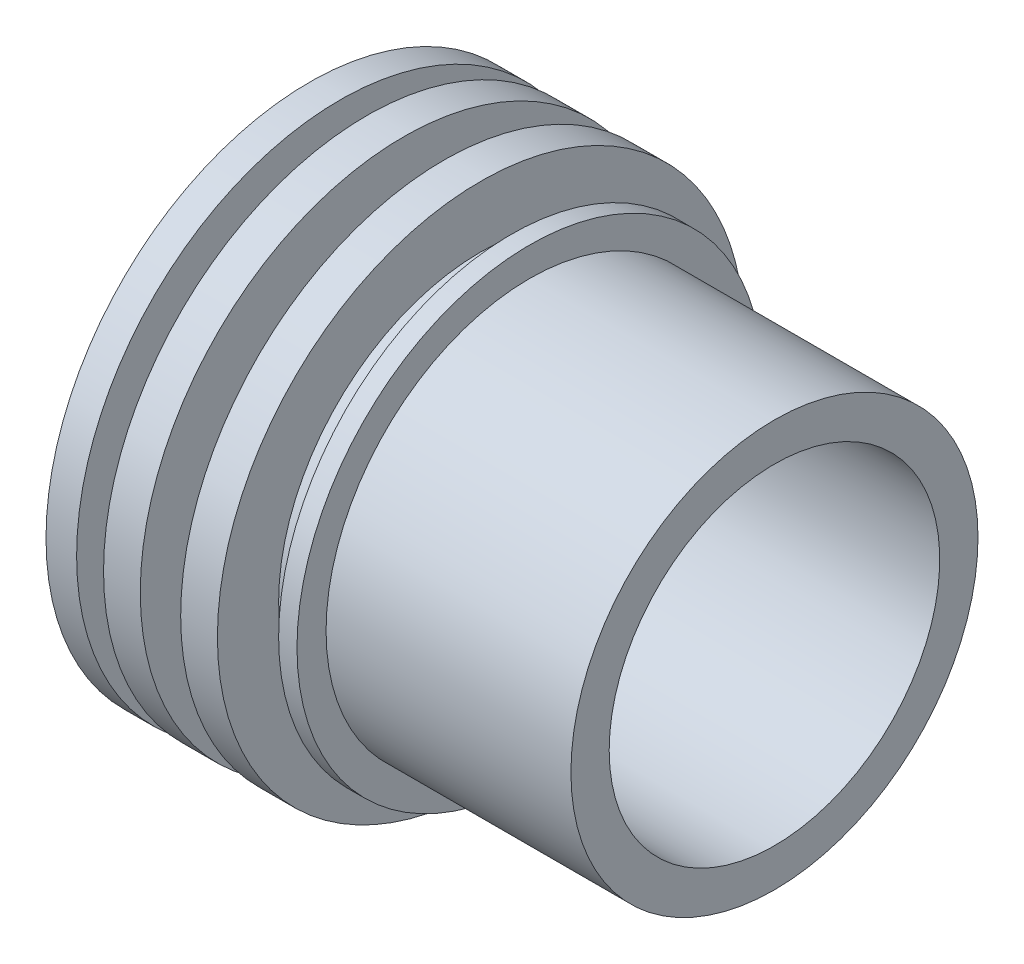
ISO-10303-21;
HEADER;
FILE_DESCRIPTION(('STEP AP214'),'2;1');
FILE_NAME('part.step','',(''),(''),'','','');
FILE_SCHEMA(('AUTOMOTIVE_DESIGN { 1 0 10303 214 1 1 1 1 }'));
ENDSEC;
DATA;
#1=APPLICATION_CONTEXT('core data for automotive mechanical design processes');
#2=APPLICATION_PROTOCOL_DEFINITION('international standard','automotive_design',2000,#1);
#3=PRODUCT_CONTEXT('',#1,'mechanical');
#4=PRODUCT('Part','Part','',(#3));
#5=PRODUCT_RELATED_PRODUCT_CATEGORY('part','',(#4));
#6=PRODUCT_DEFINITION_FORMATION('','',#4);
#7=PRODUCT_DEFINITION_CONTEXT('part definition',#1,'design');
#8=PRODUCT_DEFINITION('design','',#6,#7);
#9=PRODUCT_DEFINITION_SHAPE('','',#8);
#10=(LENGTH_UNIT() NAMED_UNIT(*) SI_UNIT(.MILLI.,.METRE.));
#11=(NAMED_UNIT(*) PLANE_ANGLE_UNIT() SI_UNIT($,.RADIAN.));
#12=(NAMED_UNIT(*) SI_UNIT($,.STERADIAN.) SOLID_ANGLE_UNIT());
#13=UNCERTAINTY_MEASURE_WITH_UNIT(LENGTH_MEASURE(1.E-05),#10,'distance_accuracy_value','');
#14=(GEOMETRIC_REPRESENTATION_CONTEXT(3) GLOBAL_UNCERTAINTY_ASSIGNED_CONTEXT((#13)) GLOBAL_UNIT_ASSIGNED_CONTEXT((#10,
#11,#12)) REPRESENTATION_CONTEXT('',''));
#15=CARTESIAN_POINT('',(0.,0.,0.));
#16=DIRECTION('',(0.,0.,1.));
#17=DIRECTION('',(1.,0.,0.));
#18=AXIS2_PLACEMENT_3D('',#15,#16,#17);
#19=CARTESIAN_POINT('',(29.5,0.,36.5));
#20=DIRECTION('',(-1.,0.,0.));
#21=DIRECTION('',(0.,0.,1.));
#22=AXIS2_PLACEMENT_3D('',#19,#20,#21);
#23=CYLINDRICAL_SURFACE('',#22,12.7);
#24=CARTESIAN_POINT('',(30.5,0.,36.5));
#25=DIRECTION('',(1.,0.,0.));
#26=DIRECTION('',(0.,0.,1.));
#27=AXIS2_PLACEMENT_3D('',#24,#25,#26);
#28=CIRCLE('',#27,12.7);
#29=CARTESIAN_POINT('',(30.5,0.,49.2));
#30=VERTEX_POINT('',#29);
#31=EDGE_CURVE('E10',#30,#30,#28,.T.);
#32=ORIENTED_EDGE('',*,*,#31,.T.);
#33=EDGE_LOOP('',(#32));
#34=FACE_BOUND('',#33,.T.);
#35=CARTESIAN_POINT('',(28.5,0.,36.5));
#36=DIRECTION('',(1.,0.,0.));
#37=DIRECTION('',(0.,0.,1.));
#38=AXIS2_PLACEMENT_3D('',#35,#36,#37);
#39=CIRCLE('',#38,12.7);
#40=CARTESIAN_POINT('',(28.5,0.,49.2));
#41=VERTEX_POINT('',#40);
#42=EDGE_CURVE('E132',#41,#41,#39,.T.);
#43=ORIENTED_EDGE('',*,*,#42,.F.);
#44=EDGE_LOOP('',(#43));
#45=FACE_BOUND('',#44,.T.);
#46=ADVANCED_FACE('F15',(#34,#45),#23,.F.);
#47=CARTESIAN_POINT('',(30.5,0.,49.6));
#48=DIRECTION('',(1.,0.,0.));
#49=DIRECTION('',(0.,0.,1.));
#50=AXIS2_PLACEMENT_3D('',#47,#48,#49);
#51=PLANE('',#50);
#52=CARTESIAN_POINT('',(30.5,0.,36.5));
#53=DIRECTION('',(1.,0.,0.));
#54=DIRECTION('',(0.,0.,1.));
#55=AXIS2_PLACEMENT_3D('',#52,#53,#54);
#56=CIRCLE('',#55,13.5);
#57=CARTESIAN_POINT('',(30.5,0.,50.));
#58=VERTEX_POINT('',#57);
#59=EDGE_CURVE('E25',#58,#58,#56,.T.);
#60=ORIENTED_EDGE('',*,*,#59,.T.);
#61=EDGE_LOOP('',(#60));
#62=FACE_BOUND('',#61,.T.);
#63=ORIENTED_EDGE('',*,*,#31,.F.);
#64=EDGE_LOOP('',(#63));
#65=FACE_BOUND('',#64,.T.);
#66=ADVANCED_FACE('F163',(#62,#65),#51,.T.);
#67=CARTESIAN_POINT('',(48.5,0.,36.5));
#68=DIRECTION('',(-1.,0.,0.));
#69=DIRECTION('',(0.,0.,1.));
#70=AXIS2_PLACEMENT_3D('',#67,#68,#69);
#71=CYLINDRICAL_SURFACE('',#70,13.5);
#72=CARTESIAN_POINT('',(66.5,0.,36.5));
#73=DIRECTION('',(1.,0.,0.));
#74=DIRECTION('',(0.,0.,1.));
#75=AXIS2_PLACEMENT_3D('',#72,#73,#74);
#76=CIRCLE('',#75,13.5);
#77=CARTESIAN_POINT('',(66.5,0.,50.));
#78=VERTEX_POINT('',#77);
#79=EDGE_CURVE('E100',#78,#78,#76,.T.);
#80=ORIENTED_EDGE('',*,*,#79,.T.);
#81=EDGE_LOOP('',(#80));
#82=FACE_BOUND('',#81,.T.);
#83=ORIENTED_EDGE('',*,*,#59,.F.);
#84=EDGE_LOOP('',(#83));
#85=FACE_BOUND('',#84,.T.);
#86=ADVANCED_FACE('F101',(#82,#85),#71,.F.);
#87=CARTESIAN_POINT('',(66.5,0.,51.5625));
#88=DIRECTION('',(1.,0.,0.));
#89=DIRECTION('',(0.,0.,1.));
#90=AXIS2_PLACEMENT_3D('',#87,#88,#89);
#91=PLANE('',#90);
#92=CARTESIAN_POINT('',(66.5,0.,36.5));
#93=DIRECTION('',(1.,0.,0.));
#94=DIRECTION('',(0.,0.,1.));
#95=AXIS2_PLACEMENT_3D('',#92,#93,#94);
#96=CIRCLE('',#95,16.625);
#97=CARTESIAN_POINT('',(66.5,0.,53.125));
#98=VERTEX_POINT('',#97);
#99=EDGE_CURVE('E104',#98,#98,#96,.T.);
#100=ORIENTED_EDGE('',*,*,#99,.T.);
#101=EDGE_LOOP('',(#100));
#102=FACE_BOUND('',#101,.T.);
#103=ORIENTED_EDGE('',*,*,#79,.F.);
#104=EDGE_LOOP('',(#103));
#105=FACE_BOUND('',#104,.T.);
#106=ADVANCED_FACE('F194',(#102,#105),#91,.T.);
#107=CARTESIAN_POINT('',(56.5,0.,36.5));
#108=DIRECTION('',(-1.,0.,0.));
#109=DIRECTION('',(0.,0.,1.));
#110=AXIS2_PLACEMENT_3D('',#107,#108,#109);
#111=CYLINDRICAL_SURFACE('',#110,16.625);
#112=CARTESIAN_POINT('',(46.5,0.,36.5));
#113=DIRECTION('',(1.,0.,0.));
#114=DIRECTION('',(0.,0.,1.));
#115=AXIS2_PLACEMENT_3D('',#112,#113,#114);
#116=CIRCLE('',#115,16.625);
#117=CARTESIAN_POINT('',(46.5,0.,53.125));
#118=VERTEX_POINT('',#117);
#119=EDGE_CURVE('E107',#118,#118,#116,.T.);
#120=ORIENTED_EDGE('',*,*,#119,.T.);
#121=EDGE_LOOP('',(#120));
#122=FACE_BOUND('',#121,.T.);
#123=ORIENTED_EDGE('',*,*,#99,.F.);
#124=EDGE_LOOP('',(#123));
#125=FACE_BOUND('',#124,.T.);
#126=ADVANCED_FACE('F232',(#122,#125),#111,.T.);
#127=CARTESIAN_POINT('',(46.5,0.,54.3125));
#128=DIRECTION('',(1.,0.,0.));
#129=DIRECTION('',(0.,0.,1.));
#130=AXIS2_PLACEMENT_3D('',#127,#128,#129);
#131=PLANE('',#130);
#132=CARTESIAN_POINT('',(46.5,0.,36.5));
#133=DIRECTION('',(1.,0.,0.));
#134=DIRECTION('',(0.,0.,1.));
#135=AXIS2_PLACEMENT_3D('',#132,#133,#134);
#136=CIRCLE('',#135,19.);
#137=CARTESIAN_POINT('',(46.5,0.,55.5));
#138=VERTEX_POINT('',#137);
#139=EDGE_CURVE('E116',#138,#138,#136,.T.);
#140=ORIENTED_EDGE('',*,*,#139,.T.);
#141=EDGE_LOOP('',(#140));
#142=FACE_BOUND('',#141,.T.);
#143=ORIENTED_EDGE('',*,*,#119,.F.);
#144=EDGE_LOOP('',(#143));
#145=FACE_BOUND('',#144,.T.);
#146=ADVANCED_FACE('F190',(#142,#145),#131,.T.);
#147=CARTESIAN_POINT('',(45.75,0.,36.5));
#148=DIRECTION('',(-1.,0.,0.));
#149=DIRECTION('',(0.,0.,1.));
#150=AXIS2_PLACEMENT_3D('',#147,#148,#149);
#151=CYLINDRICAL_SURFACE('',#150,19.);
#152=CARTESIAN_POINT('',(45.,0.,36.5));
#153=DIRECTION('',(1.,0.,0.));
#154=DIRECTION('',(0.,0.,1.));
#155=AXIS2_PLACEMENT_3D('',#152,#153,#154);
#156=CIRCLE('',#155,19.);
#157=CARTESIAN_POINT('',(45.,0.,55.5));
#158=VERTEX_POINT('',#157);
#159=EDGE_CURVE('E118',#158,#158,#156,.T.);
#160=ORIENTED_EDGE('',*,*,#159,.T.);
#161=EDGE_LOOP('',(#160));
#162=FACE_BOUND('',#161,.T.);
#163=ORIENTED_EDGE('',*,*,#139,.F.);
#164=EDGE_LOOP('',(#163));
#165=FACE_BOUND('',#164,.T.);
#166=ADVANCED_FACE('F187',(#162,#165),#151,.T.);
#167=CARTESIAN_POINT('',(45.,0.,54.25));
#168=DIRECTION('',(-1.,0.,0.));
#169=DIRECTION('',(0.,0.,-1.));
#170=AXIS2_PLACEMENT_3D('',#167,#168,#169);
#171=PLANE('',#170);
#172=CARTESIAN_POINT('',(45.,0.,36.5));
#173=DIRECTION('',(1.,0.,0.));
#174=DIRECTION('',(0.,0.,1.));
#175=AXIS2_PLACEMENT_3D('',#172,#173,#174);
#176=CIRCLE('',#175,16.5);
#177=CARTESIAN_POINT('',(45.,0.,53.));
#178=VERTEX_POINT('',#177);
#179=EDGE_CURVE('E126',#178,#178,#176,.T.);
#180=ORIENTED_EDGE('',*,*,#179,.T.);
#181=EDGE_LOOP('',(#180));
#182=FACE_BOUND('',#181,.T.);
#183=ORIENTED_EDGE('',*,*,#159,.F.);
#184=EDGE_LOOP('',(#183));
#185=FACE_BOUND('',#184,.T.);
#186=ADVANCED_FACE('F179',(#182,#185),#171,.T.);
#187=CARTESIAN_POINT('',(43.75,0.,36.5));
#188=DIRECTION('',(-1.,0.,0.));
#189=DIRECTION('',(0.,0.,1.));
#190=AXIS2_PLACEMENT_3D('',#187,#188,#189);
#191=CYLINDRICAL_SURFACE('',#190,16.5);
#192=CARTESIAN_POINT('',(42.5,0.,36.5));
#193=DIRECTION('',(1.,0.,0.));
#194=DIRECTION('',(0.,0.,1.));
#195=AXIS2_PLACEMENT_3D('',#192,#193,#194);
#196=CIRCLE('',#195,16.5);
#197=CARTESIAN_POINT('',(42.5,0.,53.));
#198=VERTEX_POINT('',#197);
#199=EDGE_CURVE('E129',#198,#198,#196,.T.);
#200=ORIENTED_EDGE('',*,*,#199,.T.);
#201=EDGE_LOOP('',(#200));
#202=FACE_BOUND('',#201,.T.);
#203=ORIENTED_EDGE('',*,*,#179,.F.);
#204=EDGE_LOOP('',(#203));
#205=FACE_BOUND('',#204,.T.);
#206=ADVANCED_FACE('F175',(#202,#205),#191,.T.);
#207=CARTESIAN_POINT('',(42.5,0.,55.5));
#208=DIRECTION('',(1.,0.,0.));
#209=DIRECTION('',(0.,0.,1.));
#210=AXIS2_PLACEMENT_3D('',#207,#208,#209);
#211=PLANE('',#210);
#212=CARTESIAN_POINT('',(42.5,0.,36.5));
#213=DIRECTION('',(1.,0.,0.));
#214=DIRECTION('',(0.,0.,1.));
#215=AXIS2_PLACEMENT_3D('',#212,#213,#214);
#216=CIRCLE('',#215,21.5);
#217=CARTESIAN_POINT('',(42.5,0.,58.));
#218=VERTEX_POINT('',#217);
#219=EDGE_CURVE('E140',#218,#218,#216,.T.);
#220=ORIENTED_EDGE('',*,*,#219,.T.);
#221=EDGE_LOOP('',(#220));
#222=FACE_BOUND('',#221,.T.);
#223=ORIENTED_EDGE('',*,*,#199,.F.);
#224=EDGE_LOOP('',(#223));
#225=FACE_BOUND('',#224,.T.);
#226=ADVANCED_FACE('F178',(#222,#225),#211,.T.);
#227=CARTESIAN_POINT('',(41.,0.,36.5));
#228=DIRECTION('',(-1.,0.,0.));
#229=DIRECTION('',(0.,0.,1.));
#230=AXIS2_PLACEMENT_3D('',#227,#228,#229);
#231=CYLINDRICAL_SURFACE('',#230,21.5);
#232=CARTESIAN_POINT('',(39.5,0.,36.5));
#233=DIRECTION('',(1.,0.,0.));
#234=DIRECTION('',(0.,0.,1.));
#235=AXIS2_PLACEMENT_3D('',#232,#233,#234);
#236=CIRCLE('',#235,21.5);
#237=CARTESIAN_POINT('',(39.5,0.,58.));
#238=VERTEX_POINT('',#237);
#239=EDGE_CURVE('E62',#238,#238,#236,.T.);
#240=ORIENTED_EDGE('',*,*,#239,.T.);
#241=EDGE_LOOP('',(#240));
#242=FACE_BOUND('',#241,.T.);
#243=ORIENTED_EDGE('',*,*,#219,.F.);
#244=EDGE_LOOP('',(#243));
#245=FACE_BOUND('',#244,.T.);
#246=ADVANCED_FACE('F17',(#242,#245),#231,.T.);
#247=CARTESIAN_POINT('',(39.5,0.,55.5));
#248=DIRECTION('',(-1.,0.,0.));
#249=DIRECTION('',(0.,0.,-1.));
#250=AXIS2_PLACEMENT_3D('',#247,#248,#249);
#251=PLANE('',#250);
#252=CARTESIAN_POINT('',(39.5,0.,36.5));
#253=DIRECTION('',(1.,0.,0.));
#254=DIRECTION('',(0.,0.,1.));
#255=AXIS2_PLACEMENT_3D('',#252,#253,#254);
#256=CIRCLE('',#255,16.5);
#257=CARTESIAN_POINT('',(39.5,0.,53.));
#258=VERTEX_POINT('',#257);
#259=EDGE_CURVE('E70',#258,#258,#256,.T.);
#260=ORIENTED_EDGE('',*,*,#259,.T.);
#261=EDGE_LOOP('',(#260));
#262=FACE_BOUND('',#261,.T.);
#263=ORIENTED_EDGE('',*,*,#239,.F.);
#264=EDGE_LOOP('',(#263));
#265=FACE_BOUND('',#264,.T.);
#266=ADVANCED_FACE('F173',(#262,#265),#251,.T.);
#267=CARTESIAN_POINT('',(37.85,0.,36.5));
#268=DIRECTION('',(-1.,0.,0.));
#269=DIRECTION('',(0.,0.,1.));
#270=AXIS2_PLACEMENT_3D('',#267,#268,#269);
#271=CYLINDRICAL_SURFACE('',#270,16.5);
#272=CARTESIAN_POINT('',(36.2,0.,36.5));
#273=DIRECTION('',(1.,0.,0.));
#274=DIRECTION('',(0.,0.,1.));
#275=AXIS2_PLACEMENT_3D('',#272,#273,#274);
#276=CIRCLE('',#275,16.5);
#277=CARTESIAN_POINT('',(36.2,0.,53.));
#278=VERTEX_POINT('',#277);
#279=EDGE_CURVE('E76',#278,#278,#276,.T.);
#280=ORIENTED_EDGE('',*,*,#279,.T.);
#281=EDGE_LOOP('',(#280));
#282=FACE_BOUND('',#281,.T.);
#283=ORIENTED_EDGE('',*,*,#259,.F.);
#284=EDGE_LOOP('',(#283));
#285=FACE_BOUND('',#284,.T.);
#286=ADVANCED_FACE('F225',(#282,#285),#271,.T.);
#287=CARTESIAN_POINT('',(36.2,0.,55.5));
#288=DIRECTION('',(1.,0.,0.));
#289=DIRECTION('',(0.,0.,1.));
#290=AXIS2_PLACEMENT_3D('',#287,#288,#289);
#291=PLANE('',#290);
#292=CARTESIAN_POINT('',(36.2,0.,36.5));
#293=DIRECTION('',(1.,0.,0.));
#294=DIRECTION('',(0.,0.,1.));
#295=AXIS2_PLACEMENT_3D('',#292,#293,#294);
#296=CIRCLE('',#295,21.5);
#297=CARTESIAN_POINT('',(36.2,0.,58.));
#298=VERTEX_POINT('',#297);
#299=EDGE_CURVE('E120',#298,#298,#296,.T.);
#300=ORIENTED_EDGE('',*,*,#299,.T.);
#301=EDGE_LOOP('',(#300));
#302=FACE_BOUND('',#301,.T.);
#303=ORIENTED_EDGE('',*,*,#279,.F.);
#304=EDGE_LOOP('',(#303));
#305=FACE_BOUND('',#304,.T.);
#306=ADVANCED_FACE('F219',(#302,#305),#291,.T.);
#307=CARTESIAN_POINT('',(34.7,0.,36.5));
#308=DIRECTION('',(-1.,0.,0.));
#309=DIRECTION('',(0.,0.,1.));
#310=AXIS2_PLACEMENT_3D('',#307,#308,#309);
#311=CYLINDRICAL_SURFACE('',#310,21.5);
#312=CARTESIAN_POINT('',(33.2,0.,36.5));
#313=DIRECTION('',(1.,0.,0.));
#314=DIRECTION('',(0.,0.,1.));
#315=AXIS2_PLACEMENT_3D('',#312,#313,#314);
#316=CIRCLE('',#315,21.5);
#317=CARTESIAN_POINT('',(33.2,0.,58.));
#318=VERTEX_POINT('',#317);
#319=EDGE_CURVE('E138',#318,#318,#316,.T.);
#320=ORIENTED_EDGE('',*,*,#319,.T.);
#321=EDGE_LOOP('',(#320));
#322=FACE_BOUND('',#321,.T.);
#323=ORIENTED_EDGE('',*,*,#299,.F.);
#324=EDGE_LOOP('',(#323));
#325=FACE_BOUND('',#324,.T.);
#326=ADVANCED_FACE('F213',(#322,#325),#311,.T.);
#327=CARTESIAN_POINT('',(33.2,0.,55.875));
#328=DIRECTION('',(-1.,0.,0.));
#329=DIRECTION('',(0.,0.,-1.));
#330=AXIS2_PLACEMENT_3D('',#327,#328,#329);
#331=PLANE('',#330);
#332=CARTESIAN_POINT('',(33.2,0.,36.5));
#333=DIRECTION('',(1.,0.,0.));
#334=DIRECTION('',(0.,0.,1.));
#335=AXIS2_PLACEMENT_3D('',#332,#333,#334);
#336=CIRCLE('',#335,17.25);
#337=CARTESIAN_POINT('',(33.2,0.,53.75));
#338=VERTEX_POINT('',#337);
#339=EDGE_CURVE('E136',#338,#338,#336,.T.);
#340=ORIENTED_EDGE('',*,*,#339,.T.);
#341=EDGE_LOOP('',(#340));
#342=FACE_BOUND('',#341,.T.);
#343=ORIENTED_EDGE('',*,*,#319,.F.);
#344=EDGE_LOOP('',(#343));
#345=FACE_BOUND('',#344,.T.);
#346=ADVANCED_FACE('F185',(#342,#345),#331,.T.);
#347=CARTESIAN_POINT('',(32.1,0.,36.5));
#348=DIRECTION('',(-1.,0.,0.));
#349=DIRECTION('',(0.,0.,1.));
#350=AXIS2_PLACEMENT_3D('',#347,#348,#349);
#351=CYLINDRICAL_SURFACE('',#350,17.25);
#352=CARTESIAN_POINT('',(31.,0.,36.5));
#353=DIRECTION('',(1.,0.,0.));
#354=DIRECTION('',(0.,0.,1.));
#355=AXIS2_PLACEMENT_3D('',#352,#353,#354);
#356=CIRCLE('',#355,17.25);
#357=CARTESIAN_POINT('',(31.,0.,53.75));
#358=VERTEX_POINT('',#357);
#359=EDGE_CURVE('E19',#358,#358,#356,.T.);
#360=ORIENTED_EDGE('',*,*,#359,.T.);
#361=EDGE_LOOP('',(#360));
#362=FACE_BOUND('',#361,.T.);
#363=ORIENTED_EDGE('',*,*,#339,.F.);
#364=EDGE_LOOP('',(#363));
#365=FACE_BOUND('',#364,.T.);
#366=ADVANCED_FACE('F181',(#362,#365),#351,.T.);
#367=CARTESIAN_POINT('',(31.,0.,55.875));
#368=DIRECTION('',(1.,0.,0.));
#369=DIRECTION('',(0.,0.,1.));
#370=AXIS2_PLACEMENT_3D('',#367,#368,#369);
#371=PLANE('',#370);
#372=CARTESIAN_POINT('',(31.,0.,36.5));
#373=DIRECTION('',(1.,0.,0.));
#374=DIRECTION('',(0.,0.,1.));
#375=AXIS2_PLACEMENT_3D('',#372,#373,#374);
#376=CIRCLE('',#375,21.5);
#377=CARTESIAN_POINT('',(31.,0.,58.));
#378=VERTEX_POINT('',#377);
#379=EDGE_CURVE('E113',#378,#378,#376,.T.);
#380=ORIENTED_EDGE('',*,*,#379,.T.);
#381=EDGE_LOOP('',(#380));
#382=FACE_BOUND('',#381,.T.);
#383=ORIENTED_EDGE('',*,*,#359,.F.);
#384=EDGE_LOOP('',(#383));
#385=FACE_BOUND('',#384,.T.);
#386=ADVANCED_FACE('F184',(#382,#385),#371,.T.);
#387=CARTESIAN_POINT('',(29.75,0.,36.5));
#388=DIRECTION('',(-1.,0.,0.));
#389=DIRECTION('',(0.,0.,1.));
#390=AXIS2_PLACEMENT_3D('',#387,#388,#389);
#391=CYLINDRICAL_SURFACE('',#390,21.5);
#392=CARTESIAN_POINT('',(28.5,0.,36.5));
#393=DIRECTION('',(1.,0.,0.));
#394=DIRECTION('',(0.,0.,1.));
#395=AXIS2_PLACEMENT_3D('',#392,#393,#394);
#396=CIRCLE('',#395,21.5);
#397=CARTESIAN_POINT('',(28.5,0.,58.));
#398=VERTEX_POINT('',#397);
#399=EDGE_CURVE('E111',#398,#398,#396,.T.);
#400=ORIENTED_EDGE('',*,*,#399,.T.);
#401=EDGE_LOOP('',(#400));
#402=FACE_BOUND('',#401,.T.);
#403=ORIENTED_EDGE('',*,*,#379,.F.);
#404=EDGE_LOOP('',(#403));
#405=FACE_BOUND('',#404,.T.);
#406=ADVANCED_FACE('F195',(#402,#405),#391,.T.);
#407=CARTESIAN_POINT('',(28.5,0.,56.));
#408=DIRECTION('',(-1.,0.,0.));
#409=DIRECTION('',(0.,0.,-1.));
#410=AXIS2_PLACEMENT_3D('',#407,#408,#409);
#411=PLANE('',#410);
#412=CARTESIAN_POINT('',(28.5,0.,36.5));
#413=DIRECTION('',(1.,0.,0.));
#414=DIRECTION('',(0.,0.,1.));
#415=AXIS2_PLACEMENT_3D('',#412,#413,#414);
#416=CIRCLE('',#415,17.5);
#417=CARTESIAN_POINT('',(28.5,0.,54.));
#418=VERTEX_POINT('',#417);
#419=EDGE_CURVE('E121',#418,#418,#416,.T.);
#420=ORIENTED_EDGE('',*,*,#419,.T.);
#421=EDGE_LOOP('',(#420));
#422=FACE_BOUND('',#421,.T.);
#423=ORIENTED_EDGE('',*,*,#399,.F.);
#424=EDGE_LOOP('',(#423));
#425=FACE_BOUND('',#424,.T.);
#426=ADVANCED_FACE('F197',(#422,#425),#411,.T.);
#427=CARTESIAN_POINT('',(29.1,0.,36.5));
#428=DIRECTION('',(-1.,0.,0.));
#429=DIRECTION('',(0.,0.,1.));
#430=AXIS2_PLACEMENT_3D('',#427,#428,#429);
#431=CYLINDRICAL_SURFACE('',#430,17.5);
#432=CARTESIAN_POINT('',(29.7,0.,36.5));
#433=DIRECTION('',(1.,0.,0.));
#434=DIRECTION('',(0.,0.,1.));
#435=AXIS2_PLACEMENT_3D('',#432,#433,#434);
#436=CIRCLE('',#435,17.5);
#437=CARTESIAN_POINT('',(29.7,0.,54.));
#438=VERTEX_POINT('',#437);
#439=EDGE_CURVE('E123',#438,#438,#436,.T.);
#440=ORIENTED_EDGE('',*,*,#439,.T.);
#441=EDGE_LOOP('',(#440));
#442=FACE_BOUND('',#441,.T.);
#443=ORIENTED_EDGE('',*,*,#419,.F.);
#444=EDGE_LOOP('',(#443));
#445=FACE_BOUND('',#444,.T.);
#446=ADVANCED_FACE('F237',(#442,#445),#431,.F.);
#447=CARTESIAN_POINT('',(29.7,0.,52.5));
#448=DIRECTION('',(-1.,0.,0.));
#449=DIRECTION('',(0.,0.,-1.));
#450=AXIS2_PLACEMENT_3D('',#447,#448,#449);
#451=PLANE('',#450);
#452=CARTESIAN_POINT('',(29.7,0.,36.5));
#453=DIRECTION('',(1.,0.,0.));
#454=DIRECTION('',(0.,0.,1.));
#455=AXIS2_PLACEMENT_3D('',#452,#453,#454);
#456=CIRCLE('',#455,14.5);
#457=CARTESIAN_POINT('',(29.7,0.,51.));
#458=VERTEX_POINT('',#457);
#459=EDGE_CURVE('E130',#458,#458,#456,.T.);
#460=ORIENTED_EDGE('',*,*,#459,.T.);
#461=EDGE_LOOP('',(#460));
#462=FACE_BOUND('',#461,.T.);
#463=ORIENTED_EDGE('',*,*,#439,.F.);
#464=EDGE_LOOP('',(#463));
#465=FACE_BOUND('',#464,.T.);
#466=ADVANCED_FACE('F158',(#462,#465),#451,.T.);
#467=CARTESIAN_POINT('',(29.1,0.,36.5));
#468=DIRECTION('',(-1.,0.,0.));
#469=DIRECTION('',(0.,0.,1.));
#470=AXIS2_PLACEMENT_3D('',#467,#468,#469);
#471=CYLINDRICAL_SURFACE('',#470,14.5);
#472=CARTESIAN_POINT('',(28.5,0.,36.5));
#473=DIRECTION('',(1.,0.,0.));
#474=DIRECTION('',(0.,0.,1.));
#475=AXIS2_PLACEMENT_3D('',#472,#473,#474);
#476=CIRCLE('',#475,14.5);
#477=CARTESIAN_POINT('',(28.5,0.,51.));
#478=VERTEX_POINT('',#477);
#479=EDGE_CURVE('E135',#478,#478,#476,.T.);
#480=ORIENTED_EDGE('',*,*,#479,.T.);
#481=EDGE_LOOP('',(#480));
#482=FACE_BOUND('',#481,.T.);
#483=ORIENTED_EDGE('',*,*,#459,.F.);
#484=EDGE_LOOP('',(#483));
#485=FACE_BOUND('',#484,.T.);
#486=ADVANCED_FACE('F147',(#482,#485),#471,.T.);
#487=CARTESIAN_POINT('',(28.5,0.,50.1));
#488=DIRECTION('',(-1.,0.,0.));
#489=DIRECTION('',(0.,0.,-1.));
#490=AXIS2_PLACEMENT_3D('',#487,#488,#489);
#491=PLANE('',#490);
#492=ORIENTED_EDGE('',*,*,#42,.T.);
#493=EDGE_LOOP('',(#492));
#494=FACE_BOUND('',#493,.T.);
#495=ORIENTED_EDGE('',*,*,#479,.F.);
#496=EDGE_LOOP('',(#495));
#497=FACE_BOUND('',#496,.T.);
#498=ADVANCED_FACE('F150',(#494,#497),#491,.T.);
#499=CLOSED_SHELL('',(#46,#66,#86,#106,#126,#146,#166,#186,#206,#226,#246,#266,#286,#306,#326,
#346,#366,#386,#406,#426,#446,#466,#486,#498));
#500=MANIFOLD_SOLID_BREP('B1',#499);
#501=ADVANCED_BREP_SHAPE_REPRESENTATION('',(#18,#500),#14);
#502=SHAPE_DEFINITION_REPRESENTATION(#9,#501);
ENDSEC;
END-ISO-10303-21;
